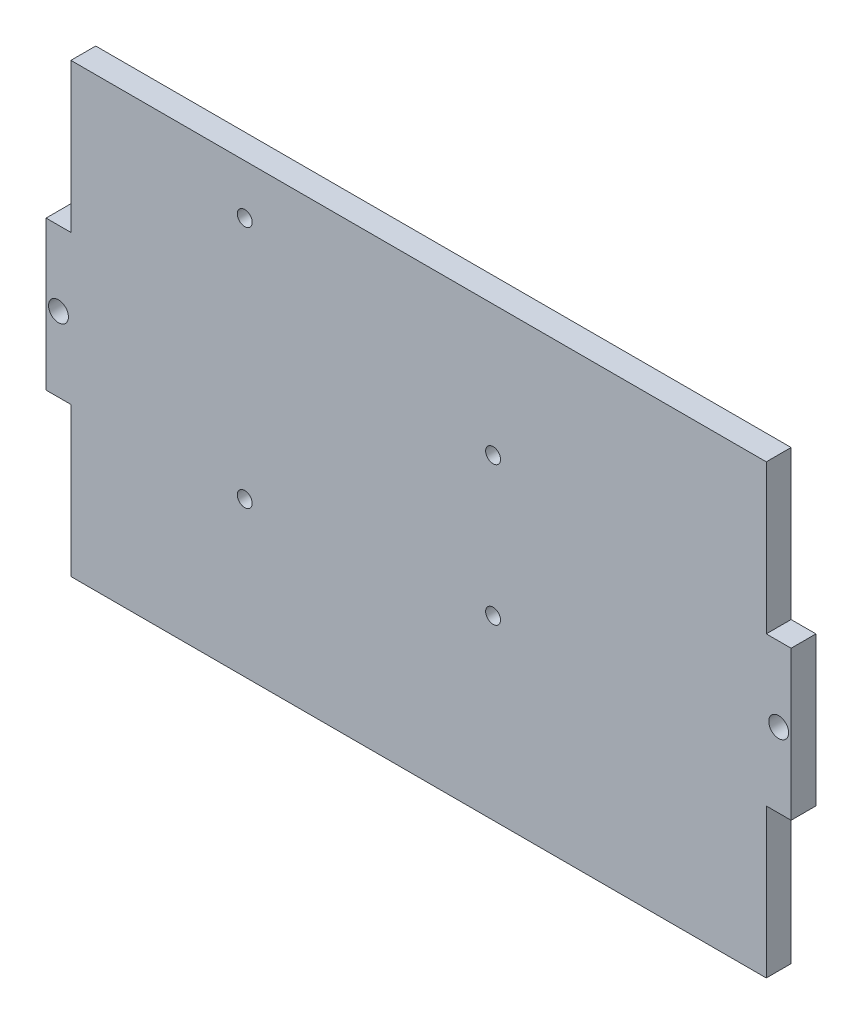
ISO-10303-21;
HEADER;
FILE_DESCRIPTION(('STEP AP214'),'2;1');
FILE_NAME('part.step','',(''),(''),'','','');
FILE_SCHEMA(('AUTOMOTIVE_DESIGN { 1 0 10303 214 1 1 1 1 }'));
ENDSEC;
DATA;
#1=APPLICATION_CONTEXT('core data for automotive mechanical design processes');
#2=APPLICATION_PROTOCOL_DEFINITION('international standard','automotive_design',2000,#1);
#3=PRODUCT_CONTEXT('',#1,'mechanical');
#4=PRODUCT('Part','Part','',(#3));
#5=PRODUCT_RELATED_PRODUCT_CATEGORY('part','',(#4));
#6=PRODUCT_DEFINITION_FORMATION('','',#4);
#7=PRODUCT_DEFINITION_CONTEXT('part definition',#1,'design');
#8=PRODUCT_DEFINITION('design','',#6,#7);
#9=PRODUCT_DEFINITION_SHAPE('','',#8);
#10=(LENGTH_UNIT() NAMED_UNIT(*) SI_UNIT(.MILLI.,.METRE.));
#11=(NAMED_UNIT(*) PLANE_ANGLE_UNIT() SI_UNIT($,.RADIAN.));
#12=(NAMED_UNIT(*) SI_UNIT($,.STERADIAN.) SOLID_ANGLE_UNIT());
#13=UNCERTAINTY_MEASURE_WITH_UNIT(LENGTH_MEASURE(1.E-05),#10,'distance_accuracy_value','');
#14=(GEOMETRIC_REPRESENTATION_CONTEXT(3) GLOBAL_UNCERTAINTY_ASSIGNED_CONTEXT((#13)) GLOBAL_UNIT_ASSIGNED_CONTEXT((#10,
#11,#12)) REPRESENTATION_CONTEXT('',''));
#15=CARTESIAN_POINT('',(0.,0.,0.));
#16=DIRECTION('',(0.,0.,1.));
#17=DIRECTION('',(1.,0.,0.));
#18=AXIS2_PLACEMENT_3D('',#15,#16,#17);
#19=CARTESIAN_POINT('',(-75.,15.,5.));
#20=DIRECTION('',(1.,0.,0.));
#21=DIRECTION('',(0.,0.,-1.));
#22=AXIS2_PLACEMENT_3D('',#19,#20,#21);
#23=PLANE('',#22);
#24=DIRECTION('',(0.,-1.,0.));
#25=VECTOR('',#24,1.);
#26=CARTESIAN_POINT('',(-75.,15.,0.));
#27=LINE('',#26,#25);
#28=CARTESIAN_POINT('',(-75.,15.,0.));
#29=VERTEX_POINT('',#28);
#30=CARTESIAN_POINT('',(-75.,-15.,0.));
#31=VERTEX_POINT('',#30);
#32=EDGE_CURVE('E155',#29,#31,#27,.T.);
#33=ORIENTED_EDGE('',*,*,#32,.T.);
#34=DIRECTION('',(0.,0.,-1.));
#35=VECTOR('',#34,1.);
#36=CARTESIAN_POINT('',(-75.,-15.,5.));
#37=LINE('',#36,#35);
#38=CARTESIAN_POINT('',(-75.,-15.,5.));
#39=VERTEX_POINT('',#38);
#40=EDGE_CURVE('E11',#39,#31,#37,.T.);
#41=ORIENTED_EDGE('',*,*,#40,.F.);
#42=DIRECTION('',(0.,-1.,0.));
#43=VECTOR('',#42,1.);
#44=CARTESIAN_POINT('',(-75.,15.,5.));
#45=LINE('',#44,#43);
#46=CARTESIAN_POINT('',(-75.,15.,5.));
#47=VERTEX_POINT('',#46);
#48=EDGE_CURVE('E178',#47,#39,#45,.T.);
#49=ORIENTED_EDGE('',*,*,#48,.F.);
#50=DIRECTION('',(0.,0.,-1.));
#51=VECTOR('',#50,1.);
#52=CARTESIAN_POINT('',(-75.,15.,5.));
#53=LINE('',#52,#51);
#54=EDGE_CURVE('E151',#47,#29,#53,.T.);
#55=ORIENTED_EDGE('',*,*,#54,.T.);
#56=EDGE_LOOP('',(#33,#41,#49,#55));
#57=FACE_BOUND('',#56,.T.);
#58=ADVANCED_FACE('F33',(#57),#23,.F.);
#59=CARTESIAN_POINT('',(-75.,-15.,5.));
#60=DIRECTION('',(0.,1.,0.));
#61=DIRECTION('',(0.,0.,1.));
#62=AXIS2_PLACEMENT_3D('',#59,#60,#61);
#63=PLANE('',#62);
#64=DIRECTION('',(1.,0.,0.));
#65=VECTOR('',#64,1.);
#66=CARTESIAN_POINT('',(-75.,-15.,0.));
#67=LINE('',#66,#65);
#68=CARTESIAN_POINT('',(-70.,-15.,0.));
#69=VERTEX_POINT('',#68);
#70=EDGE_CURVE('E158',#31,#69,#67,.T.);
#71=ORIENTED_EDGE('',*,*,#70,.T.);
#72=DIRECTION('',(0.,0.,-1.));
#73=VECTOR('',#72,1.);
#74=CARTESIAN_POINT('',(-70.,-15.,5.));
#75=LINE('',#74,#73);
#76=CARTESIAN_POINT('',(-70.,-15.,5.));
#77=VERTEX_POINT('',#76);
#78=EDGE_CURVE('E42',#77,#69,#75,.T.);
#79=ORIENTED_EDGE('',*,*,#78,.F.);
#80=DIRECTION('',(1.,0.,0.));
#81=VECTOR('',#80,1.);
#82=CARTESIAN_POINT('',(-75.,-15.,5.));
#83=LINE('',#82,#81);
#84=EDGE_CURVE('E106',#39,#77,#83,.T.);
#85=ORIENTED_EDGE('',*,*,#84,.F.);
#86=ORIENTED_EDGE('',*,*,#40,.T.);
#87=EDGE_LOOP('',(#71,#79,#85,#86));
#88=FACE_BOUND('',#87,.T.);
#89=ADVANCED_FACE('F280',(#88),#63,.F.);
#90=CARTESIAN_POINT('',(-70.,-15.,5.));
#91=DIRECTION('',(1.,0.,0.));
#92=DIRECTION('',(0.,0.,-1.));
#93=AXIS2_PLACEMENT_3D('',#90,#91,#92);
#94=PLANE('',#93);
#95=DIRECTION('',(0.,-1.,0.));
#96=VECTOR('',#95,1.);
#97=CARTESIAN_POINT('',(-70.,-15.,0.));
#98=LINE('',#97,#96);
#99=CARTESIAN_POINT('',(-70.,-45.,0.));
#100=VERTEX_POINT('',#99);
#101=EDGE_CURVE('E161',#69,#100,#98,.T.);
#102=ORIENTED_EDGE('',*,*,#101,.T.);
#103=DIRECTION('',(0.,0.,-1.));
#104=VECTOR('',#103,1.);
#105=CARTESIAN_POINT('',(-70.,-45.,5.));
#106=LINE('',#105,#104);
#107=CARTESIAN_POINT('',(-70.,-45.,5.));
#108=VERTEX_POINT('',#107);
#109=EDGE_CURVE('E197',#108,#100,#106,.T.);
#110=ORIENTED_EDGE('',*,*,#109,.F.);
#111=DIRECTION('',(0.,-1.,0.));
#112=VECTOR('',#111,1.);
#113=CARTESIAN_POINT('',(-70.,-15.,5.));
#114=LINE('',#113,#112);
#115=EDGE_CURVE('E239',#77,#108,#114,.T.);
#116=ORIENTED_EDGE('',*,*,#115,.F.);
#117=ORIENTED_EDGE('',*,*,#78,.T.);
#118=EDGE_LOOP('',(#102,#110,#116,#117));
#119=FACE_BOUND('',#118,.T.);
#120=ADVANCED_FACE('F284',(#119),#94,.F.);
#121=CARTESIAN_POINT('',(-70.,-45.,5.));
#122=DIRECTION('',(0.,1.,0.));
#123=DIRECTION('',(0.,0.,1.));
#124=AXIS2_PLACEMENT_3D('',#121,#122,#123);
#125=PLANE('',#124);
#126=DIRECTION('',(1.,0.,0.));
#127=VECTOR('',#126,1.);
#128=CARTESIAN_POINT('',(-70.,-45.,0.));
#129=LINE('',#128,#127);
#130=CARTESIAN_POINT('',(70.,-45.,0.));
#131=VERTEX_POINT('',#130);
#132=EDGE_CURVE('E163',#100,#131,#129,.T.);
#133=ORIENTED_EDGE('',*,*,#132,.T.);
#134=DIRECTION('',(0.,0.,-1.));
#135=VECTOR('',#134,1.);
#136=CARTESIAN_POINT('',(70.,-45.,5.));
#137=LINE('',#136,#135);
#138=CARTESIAN_POINT('',(70.,-45.,5.));
#139=VERTEX_POINT('',#138);
#140=EDGE_CURVE('E194',#139,#131,#137,.T.);
#141=ORIENTED_EDGE('',*,*,#140,.F.);
#142=DIRECTION('',(1.,0.,0.));
#143=VECTOR('',#142,1.);
#144=CARTESIAN_POINT('',(-70.,-45.,5.));
#145=LINE('',#144,#143);
#146=EDGE_CURVE('E241',#108,#139,#145,.T.);
#147=ORIENTED_EDGE('',*,*,#146,.F.);
#148=ORIENTED_EDGE('',*,*,#109,.T.);
#149=EDGE_LOOP('',(#133,#141,#147,#148));
#150=FACE_BOUND('',#149,.T.);
#151=ADVANCED_FACE('F288',(#150),#125,.F.);
#152=CARTESIAN_POINT('',(70.,-15.,5.));
#153=DIRECTION('',(-1.,0.,0.));
#154=DIRECTION('',(0.,0.,1.));
#155=AXIS2_PLACEMENT_3D('',#152,#153,#154);
#156=PLANE('',#155);
#157=DIRECTION('',(0.,1.,0.));
#158=VECTOR('',#157,1.);
#159=CARTESIAN_POINT('',(70.,-15.,0.));
#160=LINE('',#159,#158);
#161=CARTESIAN_POINT('',(70.,-15.,0.));
#162=VERTEX_POINT('',#161);
#163=EDGE_CURVE('E165',#131,#162,#160,.T.);
#164=ORIENTED_EDGE('',*,*,#163,.T.);
#165=DIRECTION('',(0.,0.,-1.));
#166=VECTOR('',#165,1.);
#167=CARTESIAN_POINT('',(70.,-15.,5.));
#168=LINE('',#167,#166);
#169=CARTESIAN_POINT('',(70.,-15.,5.));
#170=VERTEX_POINT('',#169);
#171=EDGE_CURVE('E191',#170,#162,#168,.T.);
#172=ORIENTED_EDGE('',*,*,#171,.F.);
#173=DIRECTION('',(0.,1.,0.));
#174=VECTOR('',#173,1.);
#175=CARTESIAN_POINT('',(70.,-15.,5.));
#176=LINE('',#175,#174);
#177=EDGE_CURVE('E243',#139,#170,#176,.T.);
#178=ORIENTED_EDGE('',*,*,#177,.F.);
#179=ORIENTED_EDGE('',*,*,#140,.T.);
#180=EDGE_LOOP('',(#164,#172,#178,#179));
#181=FACE_BOUND('',#180,.T.);
#182=ADVANCED_FACE('F294',(#181),#156,.F.);
#183=CARTESIAN_POINT('',(70.,-15.,5.));
#184=DIRECTION('',(0.,1.,0.));
#185=DIRECTION('',(-1.,0.,0.));
#186=AXIS2_PLACEMENT_3D('',#183,#184,#185);
#187=PLANE('',#186);
#188=DIRECTION('',(1.,0.,0.));
#189=VECTOR('',#188,1.);
#190=CARTESIAN_POINT('',(70.,-15.,0.));
#191=LINE('',#190,#189);
#192=CARTESIAN_POINT('',(75.,-15.,0.));
#193=VERTEX_POINT('',#192);
#194=EDGE_CURVE('E167',#162,#193,#191,.T.);
#195=ORIENTED_EDGE('',*,*,#194,.T.);
#196=DIRECTION('',(0.,0.,-1.));
#197=VECTOR('',#196,1.);
#198=CARTESIAN_POINT('',(75.,-15.,5.));
#199=LINE('',#198,#197);
#200=CARTESIAN_POINT('',(75.,-15.,5.));
#201=VERTEX_POINT('',#200);
#202=EDGE_CURVE('E188',#201,#193,#199,.T.);
#203=ORIENTED_EDGE('',*,*,#202,.F.);
#204=DIRECTION('',(1.,0.,0.));
#205=VECTOR('',#204,1.);
#206=CARTESIAN_POINT('',(70.,-15.,5.));
#207=LINE('',#206,#205);
#208=EDGE_CURVE('E245',#170,#201,#207,.T.);
#209=ORIENTED_EDGE('',*,*,#208,.F.);
#210=ORIENTED_EDGE('',*,*,#171,.T.);
#211=EDGE_LOOP('',(#195,#203,#209,#210));
#212=FACE_BOUND('',#211,.T.);
#213=ADVANCED_FACE('F298',(#212),#187,.F.);
#214=CARTESIAN_POINT('',(75.,15.,5.));
#215=DIRECTION('',(-1.,0.,0.));
#216=DIRECTION('',(0.,0.,1.));
#217=AXIS2_PLACEMENT_3D('',#214,#215,#216);
#218=PLANE('',#217);
#219=DIRECTION('',(0.,1.,0.));
#220=VECTOR('',#219,1.);
#221=CARTESIAN_POINT('',(75.,15.,0.));
#222=LINE('',#221,#220);
#223=CARTESIAN_POINT('',(75.,15.,0.));
#224=VERTEX_POINT('',#223);
#225=EDGE_CURVE('E169',#193,#224,#222,.T.);
#226=ORIENTED_EDGE('',*,*,#225,.T.);
#227=DIRECTION('',(0.,0.,-1.));
#228=VECTOR('',#227,1.);
#229=CARTESIAN_POINT('',(75.,15.,5.));
#230=LINE('',#229,#228);
#231=CARTESIAN_POINT('',(75.,15.,5.));
#232=VERTEX_POINT('',#231);
#233=EDGE_CURVE('E185',#232,#224,#230,.T.);
#234=ORIENTED_EDGE('',*,*,#233,.F.);
#235=DIRECTION('',(0.,1.,0.));
#236=VECTOR('',#235,1.);
#237=CARTESIAN_POINT('',(75.,15.,5.));
#238=LINE('',#237,#236);
#239=EDGE_CURVE('E247',#201,#232,#238,.T.);
#240=ORIENTED_EDGE('',*,*,#239,.F.);
#241=ORIENTED_EDGE('',*,*,#202,.T.);
#242=EDGE_LOOP('',(#226,#234,#240,#241));
#243=FACE_BOUND('',#242,.T.);
#244=ADVANCED_FACE('F302',(#243),#218,.F.);
#245=CARTESIAN_POINT('',(70.,15.,5.));
#246=DIRECTION('',(0.,-1.,0.));
#247=DIRECTION('',(1.,0.,0.));
#248=AXIS2_PLACEMENT_3D('',#245,#246,#247);
#249=PLANE('',#248);
#250=DIRECTION('',(-1.,0.,0.));
#251=VECTOR('',#250,1.);
#252=CARTESIAN_POINT('',(70.,15.,0.));
#253=LINE('',#252,#251);
#254=CARTESIAN_POINT('',(70.,15.,0.));
#255=VERTEX_POINT('',#254);
#256=EDGE_CURVE('E171',#224,#255,#253,.T.);
#257=ORIENTED_EDGE('',*,*,#256,.T.);
#258=DIRECTION('',(0.,0.,-1.));
#259=VECTOR('',#258,1.);
#260=CARTESIAN_POINT('',(70.,15.,5.));
#261=LINE('',#260,#259);
#262=CARTESIAN_POINT('',(70.,15.,5.));
#263=VERTEX_POINT('',#262);
#264=EDGE_CURVE('E182',#263,#255,#261,.T.);
#265=ORIENTED_EDGE('',*,*,#264,.F.);
#266=DIRECTION('',(-1.,0.,0.));
#267=VECTOR('',#266,1.);
#268=CARTESIAN_POINT('',(70.,15.,5.));
#269=LINE('',#268,#267);
#270=EDGE_CURVE('E249',#232,#263,#269,.T.);
#271=ORIENTED_EDGE('',*,*,#270,.F.);
#272=ORIENTED_EDGE('',*,*,#233,.T.);
#273=EDGE_LOOP('',(#257,#265,#271,#272));
#274=FACE_BOUND('',#273,.T.);
#275=ADVANCED_FACE('F255',(#274),#249,.F.);
#276=CARTESIAN_POINT('',(70.,45.,5.));
#277=DIRECTION('',(-1.,0.,0.));
#278=DIRECTION('',(0.,-1.,0.));
#279=AXIS2_PLACEMENT_3D('',#276,#277,#278);
#280=PLANE('',#279);
#281=DIRECTION('',(0.,1.,0.));
#282=VECTOR('',#281,1.);
#283=CARTESIAN_POINT('',(70.,45.,0.));
#284=LINE('',#283,#282);
#285=CARTESIAN_POINT('',(70.,45.,0.));
#286=VERTEX_POINT('',#285);
#287=EDGE_CURVE('E173',#255,#286,#284,.T.);
#288=ORIENTED_EDGE('',*,*,#287,.T.);
#289=DIRECTION('',(0.,0.,-1.));
#290=VECTOR('',#289,1.);
#291=CARTESIAN_POINT('',(70.,45.,5.));
#292=LINE('',#291,#290);
#293=CARTESIAN_POINT('',(70.,45.,5.));
#294=VERTEX_POINT('',#293);
#295=EDGE_CURVE('E146',#294,#286,#292,.T.);
#296=ORIENTED_EDGE('',*,*,#295,.F.);
#297=DIRECTION('',(0.,1.,0.));
#298=VECTOR('',#297,1.);
#299=CARTESIAN_POINT('',(70.,45.,5.));
#300=LINE('',#299,#298);
#301=EDGE_CURVE('E137',#263,#294,#300,.T.);
#302=ORIENTED_EDGE('',*,*,#301,.F.);
#303=ORIENTED_EDGE('',*,*,#264,.T.);
#304=EDGE_LOOP('',(#288,#296,#302,#303));
#305=FACE_BOUND('',#304,.T.);
#306=ADVANCED_FACE('F259',(#305),#280,.F.);
#307=CARTESIAN_POINT('',(-70.,45.,5.));
#308=DIRECTION('',(0.,-1.,0.));
#309=DIRECTION('',(0.,0.,-1.));
#310=AXIS2_PLACEMENT_3D('',#307,#308,#309);
#311=PLANE('',#310);
#312=DIRECTION('',(-1.,0.,0.));
#313=VECTOR('',#312,1.);
#314=CARTESIAN_POINT('',(-70.,45.,0.));
#315=LINE('',#314,#313);
#316=CARTESIAN_POINT('',(-70.,45.,0.));
#317=VERTEX_POINT('',#316);
#318=EDGE_CURVE('E145',#286,#317,#315,.T.);
#319=ORIENTED_EDGE('',*,*,#318,.T.);
#320=DIRECTION('',(0.,0.,-1.));
#321=VECTOR('',#320,1.);
#322=CARTESIAN_POINT('',(-70.,45.,5.));
#323=LINE('',#322,#321);
#324=CARTESIAN_POINT('',(-70.,45.,5.));
#325=VERTEX_POINT('',#324);
#326=EDGE_CURVE('E142',#325,#317,#323,.T.);
#327=ORIENTED_EDGE('',*,*,#326,.F.);
#328=DIRECTION('',(-1.,0.,0.));
#329=VECTOR('',#328,1.);
#330=CARTESIAN_POINT('',(-70.,45.,5.));
#331=LINE('',#330,#329);
#332=EDGE_CURVE('E131',#294,#325,#331,.T.);
#333=ORIENTED_EDGE('',*,*,#332,.F.);
#334=ORIENTED_EDGE('',*,*,#295,.T.);
#335=EDGE_LOOP('',(#319,#327,#333,#334));
#336=FACE_BOUND('',#335,.T.);
#337=ADVANCED_FACE('F143',(#336),#311,.F.);
#338=CARTESIAN_POINT('',(-70.,45.,5.));
#339=DIRECTION('',(1.,0.,0.));
#340=DIRECTION('',(0.,0.,-1.));
#341=AXIS2_PLACEMENT_3D('',#338,#339,#340);
#342=PLANE('',#341);
#343=DIRECTION('',(0.,-1.,0.));
#344=VECTOR('',#343,1.);
#345=CARTESIAN_POINT('',(-70.,45.,0.));
#346=LINE('',#345,#344);
#347=CARTESIAN_POINT('',(-70.,15.,0.));
#348=VERTEX_POINT('',#347);
#349=EDGE_CURVE('E92',#317,#348,#346,.T.);
#350=ORIENTED_EDGE('',*,*,#349,.T.);
#351=DIRECTION('',(0.,0.,-1.));
#352=VECTOR('',#351,1.);
#353=CARTESIAN_POINT('',(-70.,15.,5.));
#354=LINE('',#353,#352);
#355=CARTESIAN_POINT('',(-70.,15.,5.));
#356=VERTEX_POINT('',#355);
#357=EDGE_CURVE('E147',#356,#348,#354,.T.);
#358=ORIENTED_EDGE('',*,*,#357,.F.);
#359=DIRECTION('',(0.,-1.,0.));
#360=VECTOR('',#359,1.);
#361=CARTESIAN_POINT('',(-70.,45.,5.));
#362=LINE('',#361,#360);
#363=EDGE_CURVE('E135',#325,#356,#362,.T.);
#364=ORIENTED_EDGE('',*,*,#363,.F.);
#365=ORIENTED_EDGE('',*,*,#326,.T.);
#366=EDGE_LOOP('',(#350,#358,#364,#365));
#367=FACE_BOUND('',#366,.T.);
#368=ADVANCED_FACE('F149',(#367),#342,.F.);
#369=CARTESIAN_POINT('',(-75.,15.,5.));
#370=DIRECTION('',(0.,-1.,0.));
#371=DIRECTION('',(1.,0.,0.));
#372=AXIS2_PLACEMENT_3D('',#369,#370,#371);
#373=PLANE('',#372);
#374=DIRECTION('',(-1.,0.,0.));
#375=VECTOR('',#374,1.);
#376=CARTESIAN_POINT('',(-75.,15.,0.));
#377=LINE('',#376,#375);
#378=EDGE_CURVE('E98',#348,#29,#377,.T.);
#379=ORIENTED_EDGE('',*,*,#378,.T.);
#380=ORIENTED_EDGE('',*,*,#54,.F.);
#381=DIRECTION('',(-1.,0.,0.));
#382=VECTOR('',#381,1.);
#383=CARTESIAN_POINT('',(-75.,15.,5.));
#384=LINE('',#383,#382);
#385=EDGE_CURVE('E51',#356,#47,#384,.T.);
#386=ORIENTED_EDGE('',*,*,#385,.F.);
#387=ORIENTED_EDGE('',*,*,#357,.T.);
#388=EDGE_LOOP('',(#379,#380,#386,#387));
#389=FACE_BOUND('',#388,.T.);
#390=ADVANCED_FACE('F267',(#389),#373,.F.);
#391=CARTESIAN_POINT('',(0.,0.,5.));
#392=DIRECTION('',(0.,0.,1.));
#393=DIRECTION('',(1.,0.,0.));
#394=AXIS2_PLACEMENT_3D('',#391,#392,#393);
#395=PLANE('',#394);
#396=CARTESIAN_POINT('',(72.5,0.,5.));
#397=DIRECTION('',(0.,0.,1.));
#398=DIRECTION('',(1.,0.,0.));
#399=AXIS2_PLACEMENT_3D('',#396,#397,#398);
#400=CIRCLE('',#399,2.);
#401=CARTESIAN_POINT('',(74.5,0.,5.));
#402=VERTEX_POINT('',#401);
#403=EDGE_CURVE('E228',#402,#402,#400,.T.);
#404=ORIENTED_EDGE('',*,*,#403,.F.);
#405=EDGE_LOOP('',(#404));
#406=FACE_BOUND('',#405,.T.);
#407=CARTESIAN_POINT('',(-72.5,0.,5.));
#408=DIRECTION('',(0.,0.,1.));
#409=DIRECTION('',(1.,0.,0.));
#410=AXIS2_PLACEMENT_3D('',#407,#408,#409);
#411=CIRCLE('',#410,2.);
#412=CARTESIAN_POINT('',(-70.5,0.,5.));
#413=VERTEX_POINT('',#412);
#414=EDGE_CURVE('E217',#413,#413,#411,.T.);
#415=ORIENTED_EDGE('',*,*,#414,.F.);
#416=EDGE_LOOP('',(#415));
#417=FACE_BOUND('',#416,.T.);
#418=CARTESIAN_POINT('',(15.,-9.34,5.));
#419=DIRECTION('',(0.,0.,1.));
#420=DIRECTION('',(1.,0.,0.));
#421=AXIS2_PLACEMENT_3D('',#418,#419,#420);
#422=CIRCLE('',#421,1.5);
#423=CARTESIAN_POINT('',(16.5,-9.34,5.));
#424=VERTEX_POINT('',#423);
#425=EDGE_CURVE('E209',#424,#424,#422,.T.);
#426=ORIENTED_EDGE('',*,*,#425,.F.);
#427=EDGE_LOOP('',(#426));
#428=FACE_BOUND('',#427,.T.);
#429=CARTESIAN_POINT('',(-35.,35.,5.));
#430=DIRECTION('',(0.,0.,1.));
#431=DIRECTION('',(1.,0.,0.));
#432=AXIS2_PLACEMENT_3D('',#429,#430,#431);
#433=CIRCLE('',#432,1.5);
#434=CARTESIAN_POINT('',(-33.5,35.,5.));
#435=VERTEX_POINT('',#434);
#436=EDGE_CURVE('E221',#435,#435,#433,.T.);
#437=ORIENTED_EDGE('',*,*,#436,.F.);
#438=EDGE_LOOP('',(#437));
#439=FACE_BOUND('',#438,.T.);
#440=CARTESIAN_POINT('',(-35.,-14.,5.));
#441=DIRECTION('',(0.,0.,1.));
#442=DIRECTION('',(1.,0.,0.));
#443=AXIS2_PLACEMENT_3D('',#440,#441,#442);
#444=CIRCLE('',#443,1.5);
#445=CARTESIAN_POINT('',(-33.5,-14.,5.));
#446=VERTEX_POINT('',#445);
#447=EDGE_CURVE('E216',#446,#446,#444,.T.);
#448=ORIENTED_EDGE('',*,*,#447,.F.);
#449=EDGE_LOOP('',(#448));
#450=FACE_BOUND('',#449,.T.);
#451=CARTESIAN_POINT('',(15.,18.66,5.));
#452=DIRECTION('',(0.,0.,1.));
#453=DIRECTION('',(1.,0.,0.));
#454=AXIS2_PLACEMENT_3D('',#451,#452,#453);
#455=CIRCLE('',#454,1.5);
#456=CARTESIAN_POINT('',(16.5,18.66,5.));
#457=VERTEX_POINT('',#456);
#458=EDGE_CURVE('E204',#457,#457,#455,.T.);
#459=ORIENTED_EDGE('',*,*,#458,.F.);
#460=EDGE_LOOP('',(#459));
#461=FACE_BOUND('',#460,.T.);
#462=ORIENTED_EDGE('',*,*,#48,.T.);
#463=ORIENTED_EDGE('',*,*,#84,.T.);
#464=ORIENTED_EDGE('',*,*,#115,.T.);
#465=ORIENTED_EDGE('',*,*,#146,.T.);
#466=ORIENTED_EDGE('',*,*,#177,.T.);
#467=ORIENTED_EDGE('',*,*,#208,.T.);
#468=ORIENTED_EDGE('',*,*,#239,.T.);
#469=ORIENTED_EDGE('',*,*,#270,.T.);
#470=ORIENTED_EDGE('',*,*,#301,.T.);
#471=ORIENTED_EDGE('',*,*,#332,.T.);
#472=ORIENTED_EDGE('',*,*,#363,.T.);
#473=ORIENTED_EDGE('',*,*,#385,.T.);
#474=EDGE_LOOP('',(#462,#463,#464,#465,#466,#467,#468,#469,#470,#471,#472,#473));
#475=FACE_BOUND('',#474,.T.);
#476=ADVANCED_FACE('F133',(#406,#417,#428,#439,#450,#461,#475),#395,.T.);
#477=CARTESIAN_POINT('',(0.,0.,0.));
#478=DIRECTION('',(0.,0.,1.));
#479=DIRECTION('',(1.,0.,0.));
#480=AXIS2_PLACEMENT_3D('',#477,#478,#479);
#481=PLANE('',#480);
#482=CARTESIAN_POINT('',(72.5,0.,0.));
#483=DIRECTION('',(0.,0.,1.));
#484=DIRECTION('',(1.,0.,0.));
#485=AXIS2_PLACEMENT_3D('',#482,#483,#484);
#486=CIRCLE('',#485,2.);
#487=CARTESIAN_POINT('',(74.5,0.,0.));
#488=VERTEX_POINT('',#487);
#489=EDGE_CURVE('E36',#488,#488,#486,.T.);
#490=ORIENTED_EDGE('',*,*,#489,.T.);
#491=EDGE_LOOP('',(#490));
#492=FACE_BOUND('',#491,.T.);
#493=CARTESIAN_POINT('',(-72.5,0.,0.));
#494=DIRECTION('',(0.,0.,1.));
#495=DIRECTION('',(1.,0.,0.));
#496=AXIS2_PLACEMENT_3D('',#493,#494,#495);
#497=CIRCLE('',#496,2.);
#498=CARTESIAN_POINT('',(-70.5,0.,0.));
#499=VERTEX_POINT('',#498);
#500=EDGE_CURVE('E214',#499,#499,#497,.T.);
#501=ORIENTED_EDGE('',*,*,#500,.T.);
#502=EDGE_LOOP('',(#501));
#503=FACE_BOUND('',#502,.T.);
#504=CARTESIAN_POINT('',(15.,-9.34,0.));
#505=DIRECTION('',(0.,0.,1.));
#506=DIRECTION('',(1.,0.,0.));
#507=AXIS2_PLACEMENT_3D('',#504,#505,#506);
#508=CIRCLE('',#507,1.5);
#509=CARTESIAN_POINT('',(16.5,-9.34,0.));
#510=VERTEX_POINT('',#509);
#511=EDGE_CURVE('E212',#510,#510,#508,.T.);
#512=ORIENTED_EDGE('',*,*,#511,.T.);
#513=EDGE_LOOP('',(#512));
#514=FACE_BOUND('',#513,.T.);
#515=CARTESIAN_POINT('',(-35.,35.,0.));
#516=DIRECTION('',(0.,0.,1.));
#517=DIRECTION('',(1.,0.,0.));
#518=AXIS2_PLACEMENT_3D('',#515,#516,#517);
#519=CIRCLE('',#518,1.5);
#520=CARTESIAN_POINT('',(-33.5,35.,0.));
#521=VERTEX_POINT('',#520);
#522=EDGE_CURVE('E208',#521,#521,#519,.T.);
#523=ORIENTED_EDGE('',*,*,#522,.T.);
#524=EDGE_LOOP('',(#523));
#525=FACE_BOUND('',#524,.T.);
#526=CARTESIAN_POINT('',(-35.,-14.,0.));
#527=DIRECTION('',(0.,0.,1.));
#528=DIRECTION('',(1.,0.,0.));
#529=AXIS2_PLACEMENT_3D('',#526,#527,#528);
#530=CIRCLE('',#529,1.5);
#531=CARTESIAN_POINT('',(-33.5,-14.,0.));
#532=VERTEX_POINT('',#531);
#533=EDGE_CURVE('E205',#532,#532,#530,.T.);
#534=ORIENTED_EDGE('',*,*,#533,.T.);
#535=EDGE_LOOP('',(#534));
#536=FACE_BOUND('',#535,.T.);
#537=CARTESIAN_POINT('',(15.,18.66,0.));
#538=DIRECTION('',(0.,0.,1.));
#539=DIRECTION('',(1.,0.,0.));
#540=AXIS2_PLACEMENT_3D('',#537,#538,#539);
#541=CIRCLE('',#540,1.5);
#542=CARTESIAN_POINT('',(16.5,18.66,0.));
#543=VERTEX_POINT('',#542);
#544=EDGE_CURVE('E159',#543,#543,#541,.T.);
#545=ORIENTED_EDGE('',*,*,#544,.T.);
#546=EDGE_LOOP('',(#545));
#547=FACE_BOUND('',#546,.T.);
#548=ORIENTED_EDGE('',*,*,#32,.F.);
#549=ORIENTED_EDGE('',*,*,#378,.F.);
#550=ORIENTED_EDGE('',*,*,#349,.F.);
#551=ORIENTED_EDGE('',*,*,#318,.F.);
#552=ORIENTED_EDGE('',*,*,#287,.F.);
#553=ORIENTED_EDGE('',*,*,#256,.F.);
#554=ORIENTED_EDGE('',*,*,#225,.F.);
#555=ORIENTED_EDGE('',*,*,#194,.F.);
#556=ORIENTED_EDGE('',*,*,#163,.F.);
#557=ORIENTED_EDGE('',*,*,#132,.F.);
#558=ORIENTED_EDGE('',*,*,#101,.F.);
#559=ORIENTED_EDGE('',*,*,#70,.F.);
#560=EDGE_LOOP('',(#548,#549,#550,#551,#552,#553,#554,#555,#556,#557,#558,#559));
#561=FACE_BOUND('',#560,.T.);
#562=ADVANCED_FACE('F262',(#492,#503,#514,#525,#536,#547,#561),#481,.F.);
#563=CARTESIAN_POINT('',(15.,18.66,-5.));
#564=DIRECTION('',(0.,0.,1.));
#565=DIRECTION('',(1.,0.,0.));
#566=AXIS2_PLACEMENT_3D('',#563,#564,#565);
#567=CYLINDRICAL_SURFACE('',#566,1.5);
#568=ORIENTED_EDGE('',*,*,#458,.T.);
#569=EDGE_LOOP('',(#568));
#570=FACE_BOUND('',#569,.T.);
#571=ORIENTED_EDGE('',*,*,#544,.F.);
#572=EDGE_LOOP('',(#571));
#573=FACE_BOUND('',#572,.T.);
#574=ADVANCED_FACE('F330',(#570,#573),#567,.F.);
#575=CARTESIAN_POINT('',(-35.,-14.,-5.));
#576=DIRECTION('',(0.,0.,1.));
#577=DIRECTION('',(1.,0.,0.));
#578=AXIS2_PLACEMENT_3D('',#575,#576,#577);
#579=CYLINDRICAL_SURFACE('',#578,1.5);
#580=ORIENTED_EDGE('',*,*,#447,.T.);
#581=EDGE_LOOP('',(#580));
#582=FACE_BOUND('',#581,.T.);
#583=ORIENTED_EDGE('',*,*,#533,.F.);
#584=EDGE_LOOP('',(#583));
#585=FACE_BOUND('',#584,.T.);
#586=ADVANCED_FACE('F335',(#582,#585),#579,.F.);
#587=CARTESIAN_POINT('',(-35.,35.,-5.));
#588=DIRECTION('',(0.,0.,1.));
#589=DIRECTION('',(1.,0.,0.));
#590=AXIS2_PLACEMENT_3D('',#587,#588,#589);
#591=CYLINDRICAL_SURFACE('',#590,1.5);
#592=ORIENTED_EDGE('',*,*,#436,.T.);
#593=EDGE_LOOP('',(#592));
#594=FACE_BOUND('',#593,.T.);
#595=ORIENTED_EDGE('',*,*,#522,.F.);
#596=EDGE_LOOP('',(#595));
#597=FACE_BOUND('',#596,.T.);
#598=ADVANCED_FACE('F347',(#594,#597),#591,.F.);
#599=CARTESIAN_POINT('',(15.,-9.34,-5.));
#600=DIRECTION('',(0.,0.,1.));
#601=DIRECTION('',(1.,0.,0.));
#602=AXIS2_PLACEMENT_3D('',#599,#600,#601);
#603=CYLINDRICAL_SURFACE('',#602,1.5);
#604=ORIENTED_EDGE('',*,*,#425,.T.);
#605=EDGE_LOOP('',(#604));
#606=FACE_BOUND('',#605,.T.);
#607=ORIENTED_EDGE('',*,*,#511,.F.);
#608=EDGE_LOOP('',(#607));
#609=FACE_BOUND('',#608,.T.);
#610=ADVANCED_FACE('F357',(#606,#609),#603,.F.);
#611=CARTESIAN_POINT('',(-72.5,0.,-5.));
#612=DIRECTION('',(0.,0.,1.));
#613=DIRECTION('',(1.,0.,0.));
#614=AXIS2_PLACEMENT_3D('',#611,#612,#613);
#615=CYLINDRICAL_SURFACE('',#614,2.);
#616=ORIENTED_EDGE('',*,*,#414,.T.);
#617=EDGE_LOOP('',(#616));
#618=FACE_BOUND('',#617,.T.);
#619=ORIENTED_EDGE('',*,*,#500,.F.);
#620=EDGE_LOOP('',(#619));
#621=FACE_BOUND('',#620,.T.);
#622=ADVANCED_FACE('F366',(#618,#621),#615,.F.);
#623=CARTESIAN_POINT('',(72.5,0.,-5.));
#624=DIRECTION('',(0.,0.,1.));
#625=DIRECTION('',(1.,0.,0.));
#626=AXIS2_PLACEMENT_3D('',#623,#624,#625);
#627=CYLINDRICAL_SURFACE('',#626,2.);
#628=ORIENTED_EDGE('',*,*,#403,.T.);
#629=EDGE_LOOP('',(#628));
#630=FACE_BOUND('',#629,.T.);
#631=ORIENTED_EDGE('',*,*,#489,.F.);
#632=EDGE_LOOP('',(#631));
#633=FACE_BOUND('',#632,.T.);
#634=ADVANCED_FACE('F383',(#630,#633),#627,.F.);
#635=CLOSED_SHELL('',(#58,#89,#120,#151,#182,#213,#244,#275,#306,#337,#368,#390,#476,#562,#574,
#586,#598,#610,#622,#634));
#636=MANIFOLD_SOLID_BREP('B2',#635);
#637=ADVANCED_BREP_SHAPE_REPRESENTATION('',(#18,#636),#14);
#638=SHAPE_DEFINITION_REPRESENTATION(#9,#637);
ENDSEC;
END-ISO-10303-21;
